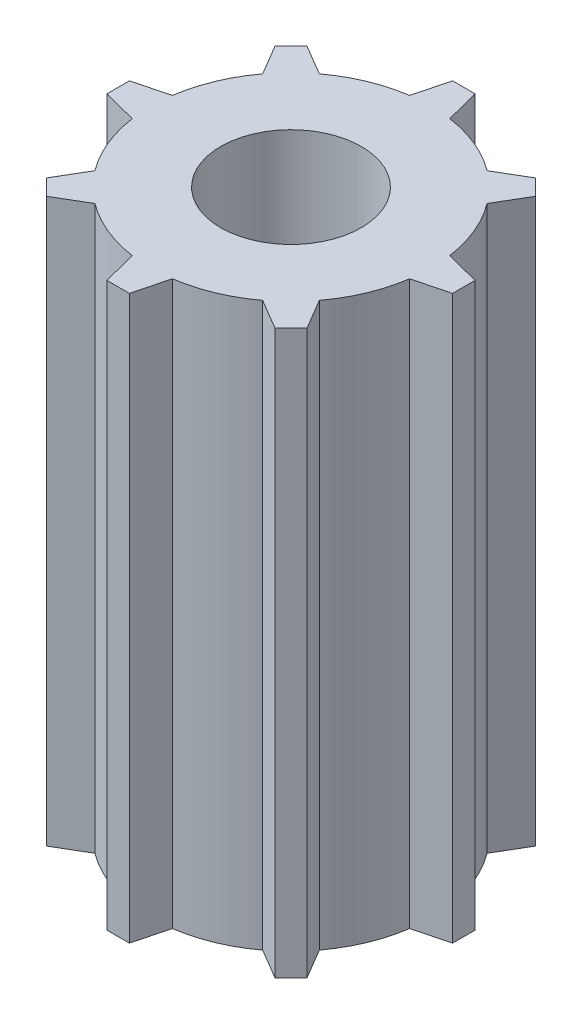
ISO-10303-21;
HEADER;
FILE_DESCRIPTION(('STEP AP214'),'2;1');
FILE_NAME('part.step','',(''),(''),'','','');
FILE_SCHEMA(('AUTOMOTIVE_DESIGN { 1 0 10303 214 1 1 1 1 }'));
ENDSEC;
DATA;
#1=APPLICATION_CONTEXT('core data for automotive mechanical design processes');
#2=APPLICATION_PROTOCOL_DEFINITION('international standard','automotive_design',2000,#1);
#3=PRODUCT_CONTEXT('',#1,'mechanical');
#4=PRODUCT('Part','Part','',(#3));
#5=PRODUCT_RELATED_PRODUCT_CATEGORY('part','',(#4));
#6=PRODUCT_DEFINITION_FORMATION('','',#4);
#7=PRODUCT_DEFINITION_CONTEXT('part definition',#1,'design');
#8=PRODUCT_DEFINITION('design','',#6,#7);
#9=PRODUCT_DEFINITION_SHAPE('','',#8);
#10=(LENGTH_UNIT() NAMED_UNIT(*) SI_UNIT(.MILLI.,.METRE.));
#11=(NAMED_UNIT(*) PLANE_ANGLE_UNIT() SI_UNIT($,.RADIAN.));
#12=(NAMED_UNIT(*) SI_UNIT($,.STERADIAN.) SOLID_ANGLE_UNIT());
#13=UNCERTAINTY_MEASURE_WITH_UNIT(LENGTH_MEASURE(1.E-05),#10,'distance_accuracy_value','');
#14=(GEOMETRIC_REPRESENTATION_CONTEXT(3) GLOBAL_UNCERTAINTY_ASSIGNED_CONTEXT((#13)) GLOBAL_UNIT_ASSIGNED_CONTEXT((#10,
#11,#12)) REPRESENTATION_CONTEXT('',''));
#15=CARTESIAN_POINT('',(0.,0.,0.));
#16=DIRECTION('',(0.,0.,1.));
#17=DIRECTION('',(1.,0.,0.));
#18=AXIS2_PLACEMENT_3D('',#15,#16,#17);
#19=CARTESIAN_POINT('',(-0.508000000001004,25.4,-7.80020665490494));
#20=DIRECTION('',(0.,0.,1.));
#21=DIRECTION('',(1.,0.,0.));
#22=AXIS2_PLACEMENT_3D('',#19,#20,#21);
#23=PLANE('',#22);
#24=DIRECTION('',(-1.,0.,0.));
#25=VECTOR('',#24,1.);
#26=CARTESIAN_POINT('',(-0.508000000001004,0.,-7.80020665490494));
#27=LINE('',#26,#25);
#28=CARTESIAN_POINT('',(0.507999999998996,0.,-7.80020665490494));
#29=VERTEX_POINT('',#28);
#30=CARTESIAN_POINT('',(-0.508000000001004,0.,-7.80020665490494));
#31=VERTEX_POINT('',#30);
#32=EDGE_CURVE('E280',#29,#31,#27,.T.);
#33=ORIENTED_EDGE('',*,*,#32,.T.);
#34=DIRECTION('',(0.,-1.,0.));
#35=VECTOR('',#34,1.);
#36=CARTESIAN_POINT('',(-0.508000000001004,25.4,-7.80020665490494));
#37=LINE('',#36,#35);
#38=CARTESIAN_POINT('',(-0.508000000001004,25.4,-7.80020665490494));
#39=VERTEX_POINT('',#38);
#40=EDGE_CURVE('E11',#39,#31,#37,.T.);
#41=ORIENTED_EDGE('',*,*,#40,.F.);
#42=DIRECTION('',(-1.,0.,0.));
#43=VECTOR('',#42,1.);
#44=CARTESIAN_POINT('',(-0.508000000001004,25.4,-7.80020665490494));
#45=LINE('',#44,#43);
#46=CARTESIAN_POINT('',(0.507999999998996,25.4,-7.80020665490494));
#47=VERTEX_POINT('',#46);
#48=EDGE_CURVE('E342',#47,#39,#45,.T.);
#49=ORIENTED_EDGE('',*,*,#48,.F.);
#50=DIRECTION('',(0.,-1.,0.));
#51=VECTOR('',#50,1.);
#52=CARTESIAN_POINT('',(0.507999999998996,25.4,-7.80020665490494));
#53=LINE('',#52,#51);
#54=EDGE_CURVE('E276',#47,#29,#53,.T.);
#55=ORIENTED_EDGE('',*,*,#54,.T.);
#56=EDGE_LOOP('',(#33,#41,#49,#55));
#57=FACE_BOUND('',#56,.T.);
#58=ADVANCED_FACE('F39',(#57),#23,.F.);
#59=CARTESIAN_POINT('',(-0.905835841654313,25.4,-6.25939506565726));
#60=DIRECTION('',(0.968245836551855,0.,0.249999999999998));
#61=DIRECTION('',(0.249999999999998,0.,-0.968245836551855));
#62=AXIS2_PLACEMENT_3D('',#59,#60,#61);
#63=PLANE('',#62);
#64=DIRECTION('',(-0.249999999999998,0.,0.968245836551855));
#65=VECTOR('',#64,1.);
#66=CARTESIAN_POINT('',(-0.905835841654313,0.,-6.25939506565726));
#67=LINE('',#66,#65);
#68=CARTESIAN_POINT('',(-0.905835841654313,0.,-6.25939506565726));
#69=VERTEX_POINT('',#68);
#70=EDGE_CURVE('E283',#31,#69,#67,.T.);
#71=ORIENTED_EDGE('',*,*,#70,.T.);
#72=DIRECTION('',(0.,-1.,0.));
#73=VECTOR('',#72,1.);
#74=CARTESIAN_POINT('',(-0.905835841654313,25.4,-6.25939506565726));
#75=LINE('',#74,#73);
#76=CARTESIAN_POINT('',(-0.905835841654313,25.4,-6.25939506565726));
#77=VERTEX_POINT('',#76);
#78=EDGE_CURVE('E48',#77,#69,#75,.T.);
#79=ORIENTED_EDGE('',*,*,#78,.F.);
#80=DIRECTION('',(-0.249999999999998,0.,0.968245836551855));
#81=VECTOR('',#80,1.);
#82=CARTESIAN_POINT('',(-0.905835841654313,25.4,-6.25939506565726));
#83=LINE('',#82,#81);
#84=EDGE_CURVE('E171',#39,#77,#83,.T.);
#85=ORIENTED_EDGE('',*,*,#84,.F.);
#86=ORIENTED_EDGE('',*,*,#40,.T.);
#87=EDGE_LOOP('',(#71,#79,#85,#86));
#88=FACE_BOUND('',#87,.T.);
#89=ADVANCED_FACE('F522',(#88),#63,.F.);
#90=CARTESIAN_POINT('',(0.,25.4,0.));
#91=DIRECTION('',(0.,-1.,0.));
#92=DIRECTION('',(0.,0.,-1.));
#93=AXIS2_PLACEMENT_3D('',#90,#91,#92);
#94=CYLINDRICAL_SURFACE('',#93,6.3246);
#95=CARTESIAN_POINT('',(0.,0.,0.));
#96=DIRECTION('',(0.,1.,0.));
#97=DIRECTION('',(0.,0.,1.));
#98=AXIS2_PLACEMENT_3D('',#95,#96,#97);
#99=CIRCLE('',#98,6.3246);
#100=CARTESIAN_POINT('',(-3.78553803077796,0.,-5.06658336332619));
#101=VERTEX_POINT('',#100);
#102=EDGE_CURVE('E285',#69,#101,#99,.T.);
#103=ORIENTED_EDGE('',*,*,#102,.T.);
#104=DIRECTION('',(0.,-1.,0.));
#105=VECTOR('',#104,1.);
#106=CARTESIAN_POINT('',(-3.78553803077796,25.4,-5.06658336332619));
#107=LINE('',#106,#105);
#108=CARTESIAN_POINT('',(-3.78553803077796,25.4,-5.06658336332619));
#109=VERTEX_POINT('',#108);
#110=EDGE_CURVE('E421',#109,#101,#107,.T.);
#111=ORIENTED_EDGE('',*,*,#110,.F.);
#112=CARTESIAN_POINT('',(0.,25.4,0.));
#113=DIRECTION('',(0.,1.,0.));
#114=DIRECTION('',(0.,0.,1.));
#115=AXIS2_PLACEMENT_3D('',#112,#113,#114);
#116=CIRCLE('',#115,6.3246);
#117=EDGE_CURVE('E430',#77,#109,#116,.T.);
#118=ORIENTED_EDGE('',*,*,#117,.F.);
#119=ORIENTED_EDGE('',*,*,#78,.T.);
#120=EDGE_LOOP('',(#103,#111,#118,#119));
#121=FACE_BOUND('',#120,.T.);
#122=ADVANCED_FACE('F428',(#121),#94,.T.);
#123=CARTESIAN_POINT('',(-3.78553803077796,25.4,-5.06658336332619));
#124=DIRECTION('',(-0.50787650158482,0.,0.861429892178095));
#125=DIRECTION('',(0.861429892178095,0.,0.50787650158482));
#126=AXIS2_PLACEMENT_3D('',#123,#124,#125);
#127=PLANE('',#126);
#128=DIRECTION('',(-0.861429892178095,0.,-0.50787650158482));
#129=VECTOR('',#128,1.);
#130=CARTESIAN_POINT('',(-3.78553803077796,0.,-5.06658336332619));
#131=LINE('',#130,#129);
#132=CARTESIAN_POINT('',(-5.15636877549766,0.,-5.87478926518178));
#133=VERTEX_POINT('',#132);
#134=EDGE_CURVE('E287',#101,#133,#131,.T.);
#135=ORIENTED_EDGE('',*,*,#134,.T.);
#136=DIRECTION('',(0.,-1.,0.));
#137=VECTOR('',#136,1.);
#138=CARTESIAN_POINT('',(-5.15636877549766,25.4,-5.87478926518178));
#139=LINE('',#138,#137);
#140=CARTESIAN_POINT('',(-5.15636877549766,25.4,-5.87478926518178));
#141=VERTEX_POINT('',#140);
#142=EDGE_CURVE('E418',#141,#133,#139,.T.);
#143=ORIENTED_EDGE('',*,*,#142,.F.);
#144=DIRECTION('',(-0.861429892178095,0.,-0.50787650158482));
#145=VECTOR('',#144,1.);
#146=CARTESIAN_POINT('',(-3.78553803077796,25.4,-5.06658336332619));
#147=LINE('',#146,#145);
#148=EDGE_CURVE('E448',#109,#141,#147,.T.);
#149=ORIENTED_EDGE('',*,*,#148,.F.);
#150=ORIENTED_EDGE('',*,*,#110,.T.);
#151=EDGE_LOOP('',(#135,#143,#149,#150));
#152=FACE_BOUND('',#151,.T.);
#153=ADVANCED_FACE('F439',(#152),#127,.F.);
#154=CARTESIAN_POINT('',(-5.8747892651832,25.4,-5.15636877549625));
#155=DIRECTION('',(0.707106781186548,0.,0.707106781186548));
#156=DIRECTION('',(0.707106781186548,0.,-0.707106781186548));
#157=AXIS2_PLACEMENT_3D('',#154,#155,#156);
#158=PLANE('',#157);
#159=DIRECTION('',(-0.707106781186548,0.,0.707106781186548));
#160=VECTOR('',#159,1.);
#161=CARTESIAN_POINT('',(-5.8747892651832,0.,-5.15636877549625));
#162=LINE('',#161,#160);
#163=CARTESIAN_POINT('',(-5.8747892651832,0.,-5.15636877549625));
#164=VERTEX_POINT('',#163);
#165=EDGE_CURVE('E289',#133,#164,#162,.T.);
#166=ORIENTED_EDGE('',*,*,#165,.T.);
#167=DIRECTION('',(0.,-1.,0.));
#168=VECTOR('',#167,1.);
#169=CARTESIAN_POINT('',(-5.8747892651832,25.4,-5.15636877549625));
#170=LINE('',#169,#168);
#171=CARTESIAN_POINT('',(-5.8747892651832,25.4,-5.15636877549625));
#172=VERTEX_POINT('',#171);
#173=EDGE_CURVE('E415',#172,#164,#170,.T.);
#174=ORIENTED_EDGE('',*,*,#173,.F.);
#175=DIRECTION('',(-0.707106781186548,0.,0.707106781186548));
#176=VECTOR('',#175,1.);
#177=CARTESIAN_POINT('',(-5.8747892651832,25.4,-5.15636877549625));
#178=LINE('',#177,#176);
#179=EDGE_CURVE('E445',#141,#172,#178,.T.);
#180=ORIENTED_EDGE('',*,*,#179,.F.);
#181=ORIENTED_EDGE('',*,*,#142,.T.);
#182=EDGE_LOOP('',(#166,#174,#180,#181));
#183=FACE_BOUND('',#182,.T.);
#184=ADVANCED_FACE('F443',(#183),#158,.F.);
#185=CARTESIAN_POINT('',(-5.06658336332745,25.4,-3.78553803077627));
#186=DIRECTION('',(0.861429892178093,0.,-0.507876501584822));
#187=DIRECTION('',(-0.507876501584823,0.,-0.861429892178094));
#188=AXIS2_PLACEMENT_3D('',#185,#186,#187);
#189=PLANE('',#188);
#190=DIRECTION('',(0.507876501584822,0.,0.861429892178094));
#191=VECTOR('',#190,1.);
#192=CARTESIAN_POINT('',(-5.06658336332745,0.,-3.78553803077627));
#193=LINE('',#192,#191);
#194=CARTESIAN_POINT('',(-5.06658336332745,0.,-3.78553803077627));
#195=VERTEX_POINT('',#194);
#196=EDGE_CURVE('E291',#164,#195,#193,.T.);
#197=ORIENTED_EDGE('',*,*,#196,.T.);
#198=DIRECTION('',(0.,-1.,0.));
#199=VECTOR('',#198,1.);
#200=CARTESIAN_POINT('',(-5.06658336332745,25.4,-3.78553803077627));
#201=LINE('',#200,#199);
#202=CARTESIAN_POINT('',(-5.06658336332745,25.4,-3.78553803077627));
#203=VERTEX_POINT('',#202);
#204=EDGE_CURVE('E412',#203,#195,#201,.T.);
#205=ORIENTED_EDGE('',*,*,#204,.F.);
#206=DIRECTION('',(0.507876501584822,0.,0.861429892178094));
#207=VECTOR('',#206,1.);
#208=CARTESIAN_POINT('',(-5.06658336332745,25.4,-3.78553803077627));
#209=LINE('',#208,#207);
#210=EDGE_CURVE('E447',#172,#203,#209,.T.);
#211=ORIENTED_EDGE('',*,*,#210,.F.);
#212=ORIENTED_EDGE('',*,*,#173,.T.);
#213=EDGE_LOOP('',(#197,#205,#211,#212));
#214=FACE_BOUND('',#213,.T.);
#215=ADVANCED_FACE('F535',(#214),#189,.F.);
#216=CARTESIAN_POINT('',(0.,25.4,0.));
#217=DIRECTION('',(0.,-1.,0.));
#218=DIRECTION('',(0.,0.,-1.));
#219=AXIS2_PLACEMENT_3D('',#216,#217,#218);
#220=CYLINDRICAL_SURFACE('',#219,6.3246);
#221=CARTESIAN_POINT('',(0.,0.,0.));
#222=DIRECTION('',(0.,1.,0.));
#223=DIRECTION('',(0.,0.,1.));
#224=AXIS2_PLACEMENT_3D('',#221,#222,#223);
#225=CIRCLE('',#224,6.3246);
#226=CARTESIAN_POINT('',(-6.25939506565756,0.,-0.905835841652237));
#227=VERTEX_POINT('',#226);
#228=EDGE_CURVE('E293',#195,#227,#225,.T.);
#229=ORIENTED_EDGE('',*,*,#228,.T.);
#230=DIRECTION('',(0.,-1.,0.));
#231=VECTOR('',#230,1.);
#232=CARTESIAN_POINT('',(-6.25939506565756,25.4,-0.905835841652237));
#233=LINE('',#232,#231);
#234=CARTESIAN_POINT('',(-6.25939506565756,25.4,-0.905835841652237));
#235=VERTEX_POINT('',#234);
#236=EDGE_CURVE('E409',#235,#227,#233,.T.);
#237=ORIENTED_EDGE('',*,*,#236,.F.);
#238=CARTESIAN_POINT('',(0.,25.4,0.));
#239=DIRECTION('',(0.,1.,0.));
#240=DIRECTION('',(0.,0.,1.));
#241=AXIS2_PLACEMENT_3D('',#238,#239,#240);
#242=CIRCLE('',#241,6.3246);
#243=EDGE_CURVE('E450',#203,#235,#242,.T.);
#244=ORIENTED_EDGE('',*,*,#243,.F.);
#245=ORIENTED_EDGE('',*,*,#204,.T.);
#246=EDGE_LOOP('',(#229,#237,#244,#245));
#247=FACE_BOUND('',#246,.T.);
#248=ADVANCED_FACE('F538',(#247),#220,.T.);
#249=CARTESIAN_POINT('',(-6.25939506565756,25.4,-0.905835841652234));
#250=DIRECTION('',(0.250000000000001,0.,0.968245836551854));
#251=DIRECTION('',(0.968245836551854,0.,-0.250000000000001));
#252=AXIS2_PLACEMENT_3D('',#249,#250,#251);
#253=PLANE('',#252);
#254=DIRECTION('',(-0.968245836551854,0.,0.250000000000001));
#255=VECTOR('',#254,1.);
#256=CARTESIAN_POINT('',(-6.25939506565756,0.,-0.905835841652234));
#257=LINE('',#256,#255);
#258=CARTESIAN_POINT('',(-7.80020665490494,0.,-0.507999999998998));
#259=VERTEX_POINT('',#258);
#260=EDGE_CURVE('E295',#227,#259,#257,.T.);
#261=ORIENTED_EDGE('',*,*,#260,.T.);
#262=DIRECTION('',(0.,-1.,0.));
#263=VECTOR('',#262,1.);
#264=CARTESIAN_POINT('',(-7.80020665490494,25.4,-0.507999999998998));
#265=LINE('',#264,#263);
#266=CARTESIAN_POINT('',(-7.80020665490494,25.4,-0.507999999998998));
#267=VERTEX_POINT('',#266);
#268=EDGE_CURVE('E406',#267,#259,#265,.T.);
#269=ORIENTED_EDGE('',*,*,#268,.F.);
#270=DIRECTION('',(-0.968245836551854,0.,0.250000000000001));
#271=VECTOR('',#270,1.);
#272=CARTESIAN_POINT('',(-6.25939506565756,25.4,-0.905835841652234));
#273=LINE('',#272,#271);
#274=EDGE_CURVE('E456',#235,#267,#273,.T.);
#275=ORIENTED_EDGE('',*,*,#274,.F.);
#276=ORIENTED_EDGE('',*,*,#236,.T.);
#277=EDGE_LOOP('',(#261,#269,#275,#276));
#278=FACE_BOUND('',#277,.T.);
#279=ADVANCED_FACE('F542',(#278),#253,.F.);
#280=CARTESIAN_POINT('',(-7.80020665490494,25.4,0.508000000001002));
#281=DIRECTION('',(1.,0.,0.));
#282=DIRECTION('',(0.,0.,-1.));
#283=AXIS2_PLACEMENT_3D('',#280,#281,#282);
#284=PLANE('',#283);
#285=DIRECTION('',(0.,0.,1.));
#286=VECTOR('',#285,1.);
#287=CARTESIAN_POINT('',(-7.80020665490494,0.,0.508000000001002));
#288=LINE('',#287,#286);
#289=CARTESIAN_POINT('',(-7.80020665490494,0.,0.508000000001002));
#290=VERTEX_POINT('',#289);
#291=EDGE_CURVE('E297',#259,#290,#288,.T.);
#292=ORIENTED_EDGE('',*,*,#291,.T.);
#293=DIRECTION('',(0.,-1.,0.));
#294=VECTOR('',#293,1.);
#295=CARTESIAN_POINT('',(-7.80020665490494,25.4,0.508000000001002));
#296=LINE('',#295,#294);
#297=CARTESIAN_POINT('',(-7.80020665490494,25.4,0.508000000001002));
#298=VERTEX_POINT('',#297);
#299=EDGE_CURVE('E403',#298,#290,#296,.T.);
#300=ORIENTED_EDGE('',*,*,#299,.F.);
#301=DIRECTION('',(0.,0.,1.));
#302=VECTOR('',#301,1.);
#303=CARTESIAN_POINT('',(-7.80020665490494,25.4,0.508000000001002));
#304=LINE('',#303,#302);
#305=EDGE_CURVE('E458',#267,#298,#304,.T.);
#306=ORIENTED_EDGE('',*,*,#305,.F.);
#307=ORIENTED_EDGE('',*,*,#268,.T.);
#308=EDGE_LOOP('',(#292,#300,#306,#307));
#309=FACE_BOUND('',#308,.T.);
#310=ADVANCED_FACE('F546',(#309),#284,.F.);
#311=CARTESIAN_POINT('',(-6.25939506565726,25.4,0.90583584165431));
#312=DIRECTION('',(0.249999999999998,0.,-0.968245836551855));
#313=DIRECTION('',(-0.968245836551855,0.,-0.249999999999998));
#314=AXIS2_PLACEMENT_3D('',#311,#312,#313);
#315=PLANE('',#314);
#316=DIRECTION('',(0.968245836551855,0.,0.249999999999998));
#317=VECTOR('',#316,1.);
#318=CARTESIAN_POINT('',(-6.25939506565726,0.,0.90583584165431));
#319=LINE('',#318,#317);
#320=CARTESIAN_POINT('',(-6.25939506565726,0.,0.90583584165431));
#321=VERTEX_POINT('',#320);
#322=EDGE_CURVE('E299',#290,#321,#319,.T.);
#323=ORIENTED_EDGE('',*,*,#322,.T.);
#324=DIRECTION('',(0.,-1.,0.));
#325=VECTOR('',#324,1.);
#326=CARTESIAN_POINT('',(-6.25939506565726,25.4,0.90583584165431));
#327=LINE('',#326,#325);
#328=CARTESIAN_POINT('',(-6.25939506565726,25.4,0.90583584165431));
#329=VERTEX_POINT('',#328);
#330=EDGE_CURVE('E400',#329,#321,#327,.T.);
#331=ORIENTED_EDGE('',*,*,#330,.F.);
#332=DIRECTION('',(0.968245836551855,0.,0.249999999999998));
#333=VECTOR('',#332,1.);
#334=CARTESIAN_POINT('',(-6.25939506565726,25.4,0.90583584165431));
#335=LINE('',#334,#333);
#336=EDGE_CURVE('E460',#298,#329,#335,.T.);
#337=ORIENTED_EDGE('',*,*,#336,.F.);
#338=ORIENTED_EDGE('',*,*,#299,.T.);
#339=EDGE_LOOP('',(#323,#331,#337,#338));
#340=FACE_BOUND('',#339,.T.);
#341=ADVANCED_FACE('F550',(#340),#315,.F.);
#342=CARTESIAN_POINT('',(0.,25.4,0.));
#343=DIRECTION('',(0.,-1.,0.));
#344=DIRECTION('',(0.,0.,-1.));
#345=AXIS2_PLACEMENT_3D('',#342,#343,#344);
#346=CYLINDRICAL_SURFACE('',#345,6.3246);
#347=CARTESIAN_POINT('',(0.,0.,0.));
#348=DIRECTION('',(0.,1.,0.));
#349=DIRECTION('',(0.,0.,1.));
#350=AXIS2_PLACEMENT_3D('',#347,#348,#349);
#351=CIRCLE('',#350,6.3246);
#352=CARTESIAN_POINT('',(-5.06658336332619,0.,3.78553803077795));
#353=VERTEX_POINT('',#352);
#354=EDGE_CURVE('E301',#321,#353,#351,.T.);
#355=ORIENTED_EDGE('',*,*,#354,.T.);
#356=DIRECTION('',(0.,-1.,0.));
#357=VECTOR('',#356,1.);
#358=CARTESIAN_POINT('',(-5.06658336332619,25.4,3.78553803077795));
#359=LINE('',#358,#357);
#360=CARTESIAN_POINT('',(-5.06658336332619,25.4,3.78553803077795));
#361=VERTEX_POINT('',#360);
#362=EDGE_CURVE('E397',#361,#353,#359,.T.);
#363=ORIENTED_EDGE('',*,*,#362,.F.);
#364=CARTESIAN_POINT('',(0.,25.4,0.));
#365=DIRECTION('',(0.,1.,0.));
#366=DIRECTION('',(0.,0.,1.));
#367=AXIS2_PLACEMENT_3D('',#364,#365,#366);
#368=CIRCLE('',#367,6.3246);
#369=EDGE_CURVE('E462',#329,#361,#368,.T.);
#370=ORIENTED_EDGE('',*,*,#369,.F.);
#371=ORIENTED_EDGE('',*,*,#330,.T.);
#372=EDGE_LOOP('',(#355,#363,#370,#371));
#373=FACE_BOUND('',#372,.T.);
#374=ADVANCED_FACE('F554',(#373),#346,.T.);
#375=CARTESIAN_POINT('',(-5.06658336332619,25.4,3.78553803077795));
#376=DIRECTION('',(0.861429892178095,0.,0.50787650158482));
#377=DIRECTION('',(0.50787650158482,0.,-0.861429892178095));
#378=AXIS2_PLACEMENT_3D('',#375,#376,#377);
#379=PLANE('',#378);
#380=DIRECTION('',(-0.50787650158482,0.,0.861429892178095));
#381=VECTOR('',#380,1.);
#382=CARTESIAN_POINT('',(-5.06658336332619,0.,3.78553803077795));
#383=LINE('',#382,#381);
#384=CARTESIAN_POINT('',(-5.87478926518178,0.,5.15636877549766));
#385=VERTEX_POINT('',#384);
#386=EDGE_CURVE('E303',#353,#385,#383,.T.);
#387=ORIENTED_EDGE('',*,*,#386,.T.);
#388=DIRECTION('',(0.,-1.,0.));
#389=VECTOR('',#388,1.);
#390=CARTESIAN_POINT('',(-5.87478926518178,25.4,5.15636877549766));
#391=LINE('',#390,#389);
#392=CARTESIAN_POINT('',(-5.87478926518178,25.4,5.15636877549766));
#393=VERTEX_POINT('',#392);
#394=EDGE_CURVE('E394',#393,#385,#391,.T.);
#395=ORIENTED_EDGE('',*,*,#394,.F.);
#396=DIRECTION('',(-0.50787650158482,0.,0.861429892178095));
#397=VECTOR('',#396,1.);
#398=CARTESIAN_POINT('',(-5.06658336332619,25.4,3.78553803077795));
#399=LINE('',#398,#397);
#400=EDGE_CURVE('E464',#361,#393,#399,.T.);
#401=ORIENTED_EDGE('',*,*,#400,.F.);
#402=ORIENTED_EDGE('',*,*,#362,.T.);
#403=EDGE_LOOP('',(#387,#395,#401,#402));
#404=FACE_BOUND('',#403,.T.);
#405=ADVANCED_FACE('F558',(#404),#379,.F.);
#406=CARTESIAN_POINT('',(-5.15636877549624,25.4,5.87478926518319));
#407=DIRECTION('',(0.707106781186548,0.,-0.707106781186548));
#408=DIRECTION('',(-0.707106781186548,0.,-0.707106781186548));
#409=AXIS2_PLACEMENT_3D('',#406,#407,#408);
#410=PLANE('',#409);
#411=DIRECTION('',(0.707106781186548,0.,0.707106781186548));
#412=VECTOR('',#411,1.);
#413=CARTESIAN_POINT('',(-5.15636877549624,0.,5.87478926518319));
#414=LINE('',#413,#412);
#415=CARTESIAN_POINT('',(-5.15636877549624,0.,5.87478926518319));
#416=VERTEX_POINT('',#415);
#417=EDGE_CURVE('E305',#385,#416,#414,.T.);
#418=ORIENTED_EDGE('',*,*,#417,.T.);
#419=DIRECTION('',(0.,-1.,0.));
#420=VECTOR('',#419,1.);
#421=CARTESIAN_POINT('',(-5.15636877549624,25.4,5.87478926518319));
#422=LINE('',#421,#420);
#423=CARTESIAN_POINT('',(-5.15636877549624,25.4,5.87478926518319));
#424=VERTEX_POINT('',#423);
#425=EDGE_CURVE('E391',#424,#416,#422,.T.);
#426=ORIENTED_EDGE('',*,*,#425,.F.);
#427=DIRECTION('',(0.707106781186548,0.,0.707106781186548));
#428=VECTOR('',#427,1.);
#429=CARTESIAN_POINT('',(-5.15636877549624,25.4,5.87478926518319));
#430=LINE('',#429,#428);
#431=EDGE_CURVE('E466',#393,#424,#430,.T.);
#432=ORIENTED_EDGE('',*,*,#431,.F.);
#433=ORIENTED_EDGE('',*,*,#394,.T.);
#434=EDGE_LOOP('',(#418,#426,#432,#433));
#435=FACE_BOUND('',#434,.T.);
#436=ADVANCED_FACE('F562',(#435),#410,.F.);
#437=CARTESIAN_POINT('',(-3.78553803077627,25.4,5.06658336332745));
#438=DIRECTION('',(-0.507876501584822,0.,-0.861429892178094));
#439=DIRECTION('',(-0.861429892178094,0.,0.507876501584822));
#440=AXIS2_PLACEMENT_3D('',#437,#438,#439);
#441=PLANE('',#440);
#442=DIRECTION('',(0.861429892178094,0.,-0.507876501584822));
#443=VECTOR('',#442,1.);
#444=CARTESIAN_POINT('',(-3.78553803077627,0.,5.06658336332745));
#445=LINE('',#444,#443);
#446=CARTESIAN_POINT('',(-3.78553803077627,0.,5.06658336332745));
#447=VERTEX_POINT('',#446);
#448=EDGE_CURVE('E307',#416,#447,#445,.T.);
#449=ORIENTED_EDGE('',*,*,#448,.T.);
#450=DIRECTION('',(0.,-1.,0.));
#451=VECTOR('',#450,1.);
#452=CARTESIAN_POINT('',(-3.78553803077627,25.4,5.06658336332745));
#453=LINE('',#452,#451);
#454=CARTESIAN_POINT('',(-3.78553803077627,25.4,5.06658336332745));
#455=VERTEX_POINT('',#454);
#456=EDGE_CURVE('E388',#455,#447,#453,.T.);
#457=ORIENTED_EDGE('',*,*,#456,.F.);
#458=DIRECTION('',(0.861429892178094,0.,-0.507876501584822));
#459=VECTOR('',#458,1.);
#460=CARTESIAN_POINT('',(-3.78553803077627,25.4,5.06658336332745));
#461=LINE('',#460,#459);
#462=EDGE_CURVE('E468',#424,#455,#461,.T.);
#463=ORIENTED_EDGE('',*,*,#462,.F.);
#464=ORIENTED_EDGE('',*,*,#425,.T.);
#465=EDGE_LOOP('',(#449,#457,#463,#464));
#466=FACE_BOUND('',#465,.T.);
#467=ADVANCED_FACE('F566',(#466),#441,.F.);
#468=CARTESIAN_POINT('',(0.,25.4,0.));
#469=DIRECTION('',(0.,-1.,0.));
#470=DIRECTION('',(0.,0.,-1.));
#471=AXIS2_PLACEMENT_3D('',#468,#469,#470);
#472=CYLINDRICAL_SURFACE('',#471,6.32459999999999);
#473=CARTESIAN_POINT('',(0.,0.,0.));
#474=DIRECTION('',(0.,1.,0.));
#475=DIRECTION('',(0.,0.,1.));
#476=AXIS2_PLACEMENT_3D('',#473,#474,#475);
#477=CIRCLE('',#476,6.32459999999999);
#478=CARTESIAN_POINT('',(-0.905835841652232,0.,6.25939506565755));
#479=VERTEX_POINT('',#478);
#480=EDGE_CURVE('E309',#447,#479,#477,.T.);
#481=ORIENTED_EDGE('',*,*,#480,.T.);
#482=DIRECTION('',(0.,-1.,0.));
#483=VECTOR('',#482,1.);
#484=CARTESIAN_POINT('',(-0.905835841652232,25.4,6.25939506565755));
#485=LINE('',#484,#483);
#486=CARTESIAN_POINT('',(-0.905835841652232,25.4,6.25939506565755));
#487=VERTEX_POINT('',#486);
#488=EDGE_CURVE('E385',#487,#479,#485,.T.);
#489=ORIENTED_EDGE('',*,*,#488,.F.);
#490=CARTESIAN_POINT('',(0.,25.4,0.));
#491=DIRECTION('',(0.,1.,0.));
#492=DIRECTION('',(0.,0.,1.));
#493=AXIS2_PLACEMENT_3D('',#490,#491,#492);
#494=CIRCLE('',#493,6.32459999999999);
#495=EDGE_CURVE('E470',#455,#487,#494,.T.);
#496=ORIENTED_EDGE('',*,*,#495,.F.);
#497=ORIENTED_EDGE('',*,*,#456,.T.);
#498=EDGE_LOOP('',(#481,#489,#496,#497));
#499=FACE_BOUND('',#498,.T.);
#500=ADVANCED_FACE('F570',(#499),#472,.T.);
#501=CARTESIAN_POINT('',(-0.905835841652232,25.4,6.25939506565755));
#502=DIRECTION('',(0.968245836551854,0.,-0.250000000000001));
#503=DIRECTION('',(-0.250000000000001,0.,-0.968245836551854));
#504=AXIS2_PLACEMENT_3D('',#501,#502,#503);
#505=PLANE('',#504);
#506=DIRECTION('',(0.250000000000001,0.,0.968245836551854));
#507=VECTOR('',#506,1.);
#508=CARTESIAN_POINT('',(-0.905835841652232,0.,6.25939506565755));
#509=LINE('',#508,#507);
#510=CARTESIAN_POINT('',(-0.507999999998996,0.,7.80020665490494));
#511=VERTEX_POINT('',#510);
#512=EDGE_CURVE('E311',#479,#511,#509,.T.);
#513=ORIENTED_EDGE('',*,*,#512,.T.);
#514=DIRECTION('',(0.,-1.,0.));
#515=VECTOR('',#514,1.);
#516=CARTESIAN_POINT('',(-0.507999999998996,25.4,7.80020665490494));
#517=LINE('',#516,#515);
#518=CARTESIAN_POINT('',(-0.507999999998996,25.4,7.80020665490494));
#519=VERTEX_POINT('',#518);
#520=EDGE_CURVE('E382',#519,#511,#517,.T.);
#521=ORIENTED_EDGE('',*,*,#520,.F.);
#522=DIRECTION('',(0.250000000000001,0.,0.968245836551854));
#523=VECTOR('',#522,1.);
#524=CARTESIAN_POINT('',(-0.905835841652232,25.4,6.25939506565755));
#525=LINE('',#524,#523);
#526=EDGE_CURVE('E472',#487,#519,#525,.T.);
#527=ORIENTED_EDGE('',*,*,#526,.F.);
#528=ORIENTED_EDGE('',*,*,#488,.T.);
#529=EDGE_LOOP('',(#513,#521,#527,#528));
#530=FACE_BOUND('',#529,.T.);
#531=ADVANCED_FACE('F574',(#530),#505,.F.);
#532=CARTESIAN_POINT('',(0.508000000001004,25.4,7.80020665490494));
#533=DIRECTION('',(0.,0.,-1.));
#534=DIRECTION('',(-1.,0.,0.));
#535=AXIS2_PLACEMENT_3D('',#532,#533,#534);
#536=PLANE('',#535);
#537=DIRECTION('',(1.,0.,0.));
#538=VECTOR('',#537,1.);
#539=CARTESIAN_POINT('',(0.508000000001004,0.,7.80020665490494));
#540=LINE('',#539,#538);
#541=CARTESIAN_POINT('',(0.508000000001004,0.,7.80020665490494));
#542=VERTEX_POINT('',#541);
#543=EDGE_CURVE('E313',#511,#542,#540,.T.);
#544=ORIENTED_EDGE('',*,*,#543,.T.);
#545=DIRECTION('',(0.,-1.,0.));
#546=VECTOR('',#545,1.);
#547=CARTESIAN_POINT('',(0.508000000001004,25.4,7.80020665490494));
#548=LINE('',#547,#546);
#549=CARTESIAN_POINT('',(0.508000000001004,25.4,7.80020665490494));
#550=VERTEX_POINT('',#549);
#551=EDGE_CURVE('E379',#550,#542,#548,.T.);
#552=ORIENTED_EDGE('',*,*,#551,.F.);
#553=DIRECTION('',(1.,0.,0.));
#554=VECTOR('',#553,1.);
#555=CARTESIAN_POINT('',(0.508000000001004,25.4,7.80020665490494));
#556=LINE('',#555,#554);
#557=EDGE_CURVE('E474',#519,#550,#556,.T.);
#558=ORIENTED_EDGE('',*,*,#557,.F.);
#559=ORIENTED_EDGE('',*,*,#520,.T.);
#560=EDGE_LOOP('',(#544,#552,#558,#559));
#561=FACE_BOUND('',#560,.T.);
#562=ADVANCED_FACE('F578',(#561),#536,.F.);
#563=CARTESIAN_POINT('',(0.905835841654312,25.4,6.25939506565725));
#564=DIRECTION('',(-0.968245836551855,0.,-0.249999999999998));
#565=DIRECTION('',(-0.249999999999998,0.,0.968245836551855));
#566=AXIS2_PLACEMENT_3D('',#563,#564,#565);
#567=PLANE('',#566);
#568=DIRECTION('',(0.249999999999998,0.,-0.968245836551855));
#569=VECTOR('',#568,1.);
#570=CARTESIAN_POINT('',(0.905835841654312,0.,6.25939506565725));
#571=LINE('',#570,#569);
#572=CARTESIAN_POINT('',(0.905835841654312,0.,6.25939506565725));
#573=VERTEX_POINT('',#572);
#574=EDGE_CURVE('E315',#542,#573,#571,.T.);
#575=ORIENTED_EDGE('',*,*,#574,.T.);
#576=DIRECTION('',(0.,-1.,0.));
#577=VECTOR('',#576,1.);
#578=CARTESIAN_POINT('',(0.905835841654312,25.4,6.25939506565725));
#579=LINE('',#578,#577);
#580=CARTESIAN_POINT('',(0.905835841654312,25.4,6.25939506565725));
#581=VERTEX_POINT('',#580);
#582=EDGE_CURVE('E376',#581,#573,#579,.T.);
#583=ORIENTED_EDGE('',*,*,#582,.F.);
#584=DIRECTION('',(0.249999999999998,0.,-0.968245836551855));
#585=VECTOR('',#584,1.);
#586=CARTESIAN_POINT('',(0.905835841654312,25.4,6.25939506565725));
#587=LINE('',#586,#585);
#588=EDGE_CURVE('E476',#550,#581,#587,.T.);
#589=ORIENTED_EDGE('',*,*,#588,.F.);
#590=ORIENTED_EDGE('',*,*,#551,.T.);
#591=EDGE_LOOP('',(#575,#583,#589,#590));
#592=FACE_BOUND('',#591,.T.);
#593=ADVANCED_FACE('F582',(#592),#567,.F.);
#594=CARTESIAN_POINT('',(0.,25.4,0.));
#595=DIRECTION('',(0.,-1.,0.));
#596=DIRECTION('',(0.,0.,-1.));
#597=AXIS2_PLACEMENT_3D('',#594,#595,#596);
#598=CYLINDRICAL_SURFACE('',#597,6.32459999999999);
#599=CARTESIAN_POINT('',(0.,0.,0.));
#600=DIRECTION('',(0.,1.,0.));
#601=DIRECTION('',(0.,0.,1.));
#602=AXIS2_PLACEMENT_3D('',#599,#600,#601);
#603=CIRCLE('',#602,6.32459999999999);
#604=CARTESIAN_POINT('',(3.78553803077795,0.,5.06658336332618));
#605=VERTEX_POINT('',#604);
#606=EDGE_CURVE('E317',#573,#605,#603,.T.);
#607=ORIENTED_EDGE('',*,*,#606,.T.);
#608=DIRECTION('',(0.,-1.,0.));
#609=VECTOR('',#608,1.);
#610=CARTESIAN_POINT('',(3.78553803077795,25.4,5.06658336332618));
#611=LINE('',#610,#609);
#612=CARTESIAN_POINT('',(3.78553803077795,25.4,5.06658336332618));
#613=VERTEX_POINT('',#612);
#614=EDGE_CURVE('E373',#613,#605,#611,.T.);
#615=ORIENTED_EDGE('',*,*,#614,.F.);
#616=CARTESIAN_POINT('',(0.,25.4,0.));
#617=DIRECTION('',(0.,1.,0.));
#618=DIRECTION('',(0.,0.,1.));
#619=AXIS2_PLACEMENT_3D('',#616,#617,#618);
#620=CIRCLE('',#619,6.32459999999999);
#621=EDGE_CURVE('E478',#581,#613,#620,.T.);
#622=ORIENTED_EDGE('',*,*,#621,.F.);
#623=ORIENTED_EDGE('',*,*,#582,.T.);
#624=EDGE_LOOP('',(#607,#615,#622,#623));
#625=FACE_BOUND('',#624,.T.);
#626=ADVANCED_FACE('F586',(#625),#598,.T.);
#627=CARTESIAN_POINT('',(3.78553803077796,25.4,5.06658336332619));
#628=DIRECTION('',(0.50787650158482,0.,-0.861429892178095));
#629=DIRECTION('',(-0.861429892178095,0.,-0.50787650158482));
#630=AXIS2_PLACEMENT_3D('',#627,#628,#629);
#631=PLANE('',#630);
#632=DIRECTION('',(0.861429892178095,0.,0.50787650158482));
#633=VECTOR('',#632,1.);
#634=CARTESIAN_POINT('',(3.78553803077796,0.,5.06658336332619));
#635=LINE('',#634,#633);
#636=CARTESIAN_POINT('',(5.15636877549766,0.,5.87478926518177));
#637=VERTEX_POINT('',#636);
#638=EDGE_CURVE('E319',#605,#637,#635,.T.);
#639=ORIENTED_EDGE('',*,*,#638,.T.);
#640=DIRECTION('',(0.,-1.,0.));
#641=VECTOR('',#640,1.);
#642=CARTESIAN_POINT('',(5.15636877549766,25.4,5.87478926518177));
#643=LINE('',#642,#641);
#644=CARTESIAN_POINT('',(5.15636877549766,25.4,5.87478926518177));
#645=VERTEX_POINT('',#644);
#646=EDGE_CURVE('E370',#645,#637,#643,.T.);
#647=ORIENTED_EDGE('',*,*,#646,.F.);
#648=DIRECTION('',(0.861429892178095,0.,0.50787650158482));
#649=VECTOR('',#648,1.);
#650=CARTESIAN_POINT('',(3.78553803077796,25.4,5.06658336332619));
#651=LINE('',#650,#649);
#652=EDGE_CURVE('E480',#613,#645,#651,.T.);
#653=ORIENTED_EDGE('',*,*,#652,.F.);
#654=ORIENTED_EDGE('',*,*,#614,.T.);
#655=EDGE_LOOP('',(#639,#647,#653,#654));
#656=FACE_BOUND('',#655,.T.);
#657=ADVANCED_FACE('F590',(#656),#631,.F.);
#658=CARTESIAN_POINT('',(5.87478926518319,25.4,5.15636877549624));
#659=DIRECTION('',(-0.707106781186548,0.,-0.707106781186548));
#660=DIRECTION('',(-0.707106781186548,0.,0.707106781186548));
#661=AXIS2_PLACEMENT_3D('',#658,#659,#660);
#662=PLANE('',#661);
#663=DIRECTION('',(0.707106781186548,0.,-0.707106781186548));
#664=VECTOR('',#663,1.);
#665=CARTESIAN_POINT('',(5.87478926518319,0.,5.15636877549624));
#666=LINE('',#665,#664);
#667=CARTESIAN_POINT('',(5.87478926518319,0.,5.15636877549624));
#668=VERTEX_POINT('',#667);
#669=EDGE_CURVE('E321',#637,#668,#666,.T.);
#670=ORIENTED_EDGE('',*,*,#669,.T.);
#671=DIRECTION('',(0.,-1.,0.));
#672=VECTOR('',#671,1.);
#673=CARTESIAN_POINT('',(5.87478926518319,25.4,5.15636877549624));
#674=LINE('',#673,#672);
#675=CARTESIAN_POINT('',(5.87478926518319,25.4,5.15636877549624));
#676=VERTEX_POINT('',#675);
#677=EDGE_CURVE('E367',#676,#668,#674,.T.);
#678=ORIENTED_EDGE('',*,*,#677,.F.);
#679=DIRECTION('',(0.707106781186548,0.,-0.707106781186548));
#680=VECTOR('',#679,1.);
#681=CARTESIAN_POINT('',(5.87478926518319,25.4,5.15636877549624));
#682=LINE('',#681,#680);
#683=EDGE_CURVE('E482',#645,#676,#682,.T.);
#684=ORIENTED_EDGE('',*,*,#683,.F.);
#685=ORIENTED_EDGE('',*,*,#646,.T.);
#686=EDGE_LOOP('',(#670,#678,#684,#685));
#687=FACE_BOUND('',#686,.T.);
#688=ADVANCED_FACE('F594',(#687),#662,.F.);
#689=CARTESIAN_POINT('',(5.06658336332745,25.4,3.78553803077627));
#690=DIRECTION('',(-0.861429892178094,0.,0.507876501584822));
#691=DIRECTION('',(0.507876501584822,0.,0.861429892178094));
#692=AXIS2_PLACEMENT_3D('',#689,#690,#691);
#693=PLANE('',#692);
#694=DIRECTION('',(-0.507876501584822,0.,-0.861429892178094));
#695=VECTOR('',#694,1.);
#696=CARTESIAN_POINT('',(5.06658336332745,0.,3.78553803077627));
#697=LINE('',#696,#695);
#698=CARTESIAN_POINT('',(5.06658336332745,0.,3.78553803077627));
#699=VERTEX_POINT('',#698);
#700=EDGE_CURVE('E323',#668,#699,#697,.T.);
#701=ORIENTED_EDGE('',*,*,#700,.T.);
#702=DIRECTION('',(0.,-1.,0.));
#703=VECTOR('',#702,1.);
#704=CARTESIAN_POINT('',(5.06658336332745,25.4,3.78553803077627));
#705=LINE('',#704,#703);
#706=CARTESIAN_POINT('',(5.06658336332745,25.4,3.78553803077627));
#707=VERTEX_POINT('',#706);
#708=EDGE_CURVE('E364',#707,#699,#705,.T.);
#709=ORIENTED_EDGE('',*,*,#708,.F.);
#710=DIRECTION('',(-0.507876501584822,0.,-0.861429892178094));
#711=VECTOR('',#710,1.);
#712=CARTESIAN_POINT('',(5.06658336332745,25.4,3.78553803077627));
#713=LINE('',#712,#711);
#714=EDGE_CURVE('E484',#676,#707,#713,.T.);
#715=ORIENTED_EDGE('',*,*,#714,.F.);
#716=ORIENTED_EDGE('',*,*,#677,.T.);
#717=EDGE_LOOP('',(#701,#709,#715,#716));
#718=FACE_BOUND('',#717,.T.);
#719=ADVANCED_FACE('F598',(#718),#693,.F.);
#720=CARTESIAN_POINT('',(0.,25.4,0.));
#721=DIRECTION('',(0.,-1.,0.));
#722=DIRECTION('',(0.,0.,-1.));
#723=AXIS2_PLACEMENT_3D('',#720,#721,#722);
#724=CYLINDRICAL_SURFACE('',#723,6.32459999999999);
#725=CARTESIAN_POINT('',(0.,0.,0.));
#726=DIRECTION('',(0.,1.,0.));
#727=DIRECTION('',(0.,0.,1.));
#728=AXIS2_PLACEMENT_3D('',#725,#726,#727);
#729=CIRCLE('',#728,6.32459999999999);
#730=CARTESIAN_POINT('',(6.25939506565755,0.,0.905835841652228));
#731=VERTEX_POINT('',#730);
#732=EDGE_CURVE('E325',#699,#731,#729,.T.);
#733=ORIENTED_EDGE('',*,*,#732,.T.);
#734=DIRECTION('',(0.,-1.,0.));
#735=VECTOR('',#734,1.);
#736=CARTESIAN_POINT('',(6.25939506565755,25.4,0.905835841652228));
#737=LINE('',#736,#735);
#738=CARTESIAN_POINT('',(6.25939506565755,25.4,0.905835841652228));
#739=VERTEX_POINT('',#738);
#740=EDGE_CURVE('E361',#739,#731,#737,.T.);
#741=ORIENTED_EDGE('',*,*,#740,.F.);
#742=CARTESIAN_POINT('',(0.,25.4,0.));
#743=DIRECTION('',(0.,1.,0.));
#744=DIRECTION('',(0.,0.,1.));
#745=AXIS2_PLACEMENT_3D('',#742,#743,#744);
#746=CIRCLE('',#745,6.32459999999999);
#747=EDGE_CURVE('E486',#707,#739,#746,.T.);
#748=ORIENTED_EDGE('',*,*,#747,.F.);
#749=ORIENTED_EDGE('',*,*,#708,.T.);
#750=EDGE_LOOP('',(#733,#741,#748,#749));
#751=FACE_BOUND('',#750,.T.);
#752=ADVANCED_FACE('F602',(#751),#724,.T.);
#753=CARTESIAN_POINT('',(6.25939506565755,25.4,0.905835841652228));
#754=DIRECTION('',(-0.250000000000001,0.,-0.968245836551854));
#755=DIRECTION('',(-0.968245836551854,0.,0.250000000000001));
#756=AXIS2_PLACEMENT_3D('',#753,#754,#755);
#757=PLANE('',#756);
#758=DIRECTION('',(0.968245836551854,0.,-0.250000000000001));
#759=VECTOR('',#758,1.);
#760=CARTESIAN_POINT('',(6.25939506565755,0.,0.905835841652228));
#761=LINE('',#760,#759);
#762=CARTESIAN_POINT('',(7.80020665490494,0.,0.507999999998993));
#763=VERTEX_POINT('',#762);
#764=EDGE_CURVE('E327',#731,#763,#761,.T.);
#765=ORIENTED_EDGE('',*,*,#764,.T.);
#766=DIRECTION('',(0.,-1.,0.));
#767=VECTOR('',#766,1.);
#768=CARTESIAN_POINT('',(7.80020665490494,25.4,0.507999999998993));
#769=LINE('',#768,#767);
#770=CARTESIAN_POINT('',(7.80020665490494,25.4,0.507999999998993));
#771=VERTEX_POINT('',#770);
#772=EDGE_CURVE('E358',#771,#763,#769,.T.);
#773=ORIENTED_EDGE('',*,*,#772,.F.);
#774=DIRECTION('',(0.968245836551854,0.,-0.250000000000001));
#775=VECTOR('',#774,1.);
#776=CARTESIAN_POINT('',(6.25939506565755,25.4,0.905835841652228));
#777=LINE('',#776,#775);
#778=EDGE_CURVE('E488',#739,#771,#777,.T.);
#779=ORIENTED_EDGE('',*,*,#778,.F.);
#780=ORIENTED_EDGE('',*,*,#740,.T.);
#781=EDGE_LOOP('',(#765,#773,#779,#780));
#782=FACE_BOUND('',#781,.T.);
#783=ADVANCED_FACE('F606',(#782),#757,.F.);
#784=CARTESIAN_POINT('',(7.80020665490494,25.4,-0.508000000001007));
#785=DIRECTION('',(-1.,0.,0.));
#786=DIRECTION('',(0.,0.,1.));
#787=AXIS2_PLACEMENT_3D('',#784,#785,#786);
#788=PLANE('',#787);
#789=DIRECTION('',(0.,0.,-1.));
#790=VECTOR('',#789,1.);
#791=CARTESIAN_POINT('',(7.80020665490494,0.,-0.508000000001007));
#792=LINE('',#791,#790);
#793=CARTESIAN_POINT('',(7.80020665490494,0.,-0.508000000001007));
#794=VERTEX_POINT('',#793);
#795=EDGE_CURVE('E329',#763,#794,#792,.T.);
#796=ORIENTED_EDGE('',*,*,#795,.T.);
#797=DIRECTION('',(0.,-1.,0.));
#798=VECTOR('',#797,1.);
#799=CARTESIAN_POINT('',(7.80020665490494,25.4,-0.508000000001007));
#800=LINE('',#799,#798);
#801=CARTESIAN_POINT('',(7.80020665490494,25.4,-0.508000000001007));
#802=VERTEX_POINT('',#801);
#803=EDGE_CURVE('E355',#802,#794,#800,.T.);
#804=ORIENTED_EDGE('',*,*,#803,.F.);
#805=DIRECTION('',(0.,0.,-1.));
#806=VECTOR('',#805,1.);
#807=CARTESIAN_POINT('',(7.80020665490494,25.4,-0.508000000001007));
#808=LINE('',#807,#806);
#809=EDGE_CURVE('E490',#771,#802,#808,.T.);
#810=ORIENTED_EDGE('',*,*,#809,.F.);
#811=ORIENTED_EDGE('',*,*,#772,.T.);
#812=EDGE_LOOP('',(#796,#804,#810,#811));
#813=FACE_BOUND('',#812,.T.);
#814=ADVANCED_FACE('F610',(#813),#788,.F.);
#815=CARTESIAN_POINT('',(6.25939506565725,25.4,-0.905835841654316));
#816=DIRECTION('',(-0.249999999999998,0.,0.968245836551855));
#817=DIRECTION('',(0.968245836551855,0.,0.249999999999998));
#818=AXIS2_PLACEMENT_3D('',#815,#816,#817);
#819=PLANE('',#818);
#820=DIRECTION('',(-0.968245836551855,0.,-0.249999999999998));
#821=VECTOR('',#820,1.);
#822=CARTESIAN_POINT('',(6.25939506565725,0.,-0.905835841654316));
#823=LINE('',#822,#821);
#824=CARTESIAN_POINT('',(6.25939506565725,0.,-0.905835841654316));
#825=VERTEX_POINT('',#824);
#826=EDGE_CURVE('E331',#794,#825,#823,.T.);
#827=ORIENTED_EDGE('',*,*,#826,.T.);
#828=DIRECTION('',(0.,-1.,0.));
#829=VECTOR('',#828,1.);
#830=CARTESIAN_POINT('',(6.25939506565725,25.4,-0.905835841654316));
#831=LINE('',#830,#829);
#832=CARTESIAN_POINT('',(6.25939506565725,25.4,-0.905835841654316));
#833=VERTEX_POINT('',#832);
#834=EDGE_CURVE('E352',#833,#825,#831,.T.);
#835=ORIENTED_EDGE('',*,*,#834,.F.);
#836=DIRECTION('',(-0.968245836551855,0.,-0.249999999999998));
#837=VECTOR('',#836,1.);
#838=CARTESIAN_POINT('',(6.25939506565725,25.4,-0.905835841654316));
#839=LINE('',#838,#837);
#840=EDGE_CURVE('E492',#802,#833,#839,.T.);
#841=ORIENTED_EDGE('',*,*,#840,.F.);
#842=ORIENTED_EDGE('',*,*,#803,.T.);
#843=EDGE_LOOP('',(#827,#835,#841,#842));
#844=FACE_BOUND('',#843,.T.);
#845=ADVANCED_FACE('F614',(#844),#819,.F.);
#846=CARTESIAN_POINT('',(0.,25.4,0.));
#847=DIRECTION('',(0.,-1.,0.));
#848=DIRECTION('',(0.,0.,-1.));
#849=AXIS2_PLACEMENT_3D('',#846,#847,#848);
#850=CYLINDRICAL_SURFACE('',#849,6.3246);
#851=CARTESIAN_POINT('',(0.,0.,0.));
#852=DIRECTION('',(0.,1.,0.));
#853=DIRECTION('',(0.,0.,1.));
#854=AXIS2_PLACEMENT_3D('',#851,#852,#853);
#855=CIRCLE('',#854,6.3246);
#856=CARTESIAN_POINT('',(5.06658336332619,0.,-3.78553803077796));
#857=VERTEX_POINT('',#856);
#858=EDGE_CURVE('E333',#825,#857,#855,.T.);
#859=ORIENTED_EDGE('',*,*,#858,.T.);
#860=DIRECTION('',(0.,-1.,0.));
#861=VECTOR('',#860,1.);
#862=CARTESIAN_POINT('',(5.06658336332619,25.4,-3.78553803077796));
#863=LINE('',#862,#861);
#864=CARTESIAN_POINT('',(5.06658336332619,25.4,-3.78553803077796));
#865=VERTEX_POINT('',#864);
#866=EDGE_CURVE('E349',#865,#857,#863,.T.);
#867=ORIENTED_EDGE('',*,*,#866,.F.);
#868=CARTESIAN_POINT('',(0.,25.4,0.));
#869=DIRECTION('',(0.,1.,0.));
#870=DIRECTION('',(0.,0.,1.));
#871=AXIS2_PLACEMENT_3D('',#868,#869,#870);
#872=CIRCLE('',#871,6.3246);
#873=EDGE_CURVE('E494',#833,#865,#872,.T.);
#874=ORIENTED_EDGE('',*,*,#873,.F.);
#875=ORIENTED_EDGE('',*,*,#834,.T.);
#876=EDGE_LOOP('',(#859,#867,#874,#875));
#877=FACE_BOUND('',#876,.T.);
#878=ADVANCED_FACE('F618',(#877),#850,.T.);
#879=CARTESIAN_POINT('',(5.06658336332619,25.4,-3.78553803077796));
#880=DIRECTION('',(-0.861429892178095,0.,-0.50787650158482));
#881=DIRECTION('',(-0.50787650158482,0.,0.861429892178095));
#882=AXIS2_PLACEMENT_3D('',#879,#880,#881);
#883=PLANE('',#882);
#884=DIRECTION('',(0.50787650158482,0.,-0.861429892178095));
#885=VECTOR('',#884,1.);
#886=CARTESIAN_POINT('',(5.06658336332619,0.,-3.78553803077796));
#887=LINE('',#886,#885);
#888=CARTESIAN_POINT('',(5.87478926518178,0.,-5.15636877549767));
#889=VERTEX_POINT('',#888);
#890=EDGE_CURVE('E335',#857,#889,#887,.T.);
#891=ORIENTED_EDGE('',*,*,#890,.T.);
#892=DIRECTION('',(0.,-1.,0.));
#893=VECTOR('',#892,1.);
#894=CARTESIAN_POINT('',(5.87478926518178,25.4,-5.15636877549767));
#895=LINE('',#894,#893);
#896=CARTESIAN_POINT('',(5.87478926518178,25.4,-5.15636877549767));
#897=VERTEX_POINT('',#896);
#898=EDGE_CURVE('E346',#897,#889,#895,.T.);
#899=ORIENTED_EDGE('',*,*,#898,.F.);
#900=DIRECTION('',(0.50787650158482,0.,-0.861429892178095));
#901=VECTOR('',#900,1.);
#902=CARTESIAN_POINT('',(5.06658336332619,25.4,-3.78553803077796));
#903=LINE('',#902,#901);
#904=EDGE_CURVE('E496',#865,#897,#903,.T.);
#905=ORIENTED_EDGE('',*,*,#904,.F.);
#906=ORIENTED_EDGE('',*,*,#866,.T.);
#907=EDGE_LOOP('',(#891,#899,#905,#906));
#908=FACE_BOUND('',#907,.T.);
#909=ADVANCED_FACE('F502',(#908),#883,.F.);
#910=CARTESIAN_POINT('',(5.15636877549624,25.4,-5.8747892651832));
#911=DIRECTION('',(-0.707106781186548,0.,0.707106781186548));
#912=DIRECTION('',(0.707106781186548,0.,0.707106781186548));
#913=AXIS2_PLACEMENT_3D('',#910,#911,#912);
#914=PLANE('',#913);
#915=DIRECTION('',(-0.707106781186548,0.,-0.707106781186548));
#916=VECTOR('',#915,1.);
#917=CARTESIAN_POINT('',(5.15636877549624,0.,-5.8747892651832));
#918=LINE('',#917,#916);
#919=CARTESIAN_POINT('',(5.15636877549624,0.,-5.8747892651832));
#920=VERTEX_POINT('',#919);
#921=EDGE_CURVE('E337',#889,#920,#918,.T.);
#922=ORIENTED_EDGE('',*,*,#921,.T.);
#923=DIRECTION('',(0.,-1.,0.));
#924=VECTOR('',#923,1.);
#925=CARTESIAN_POINT('',(5.15636877549624,25.4,-5.8747892651832));
#926=LINE('',#925,#924);
#927=CARTESIAN_POINT('',(5.15636877549624,25.4,-5.8747892651832));
#928=VERTEX_POINT('',#927);
#929=EDGE_CURVE('E271',#928,#920,#926,.T.);
#930=ORIENTED_EDGE('',*,*,#929,.F.);
#931=DIRECTION('',(-0.707106781186548,0.,-0.707106781186548));
#932=VECTOR('',#931,1.);
#933=CARTESIAN_POINT('',(5.15636877549624,25.4,-5.8747892651832));
#934=LINE('',#933,#932);
#935=EDGE_CURVE('E262',#897,#928,#934,.T.);
#936=ORIENTED_EDGE('',*,*,#935,.F.);
#937=ORIENTED_EDGE('',*,*,#898,.T.);
#938=EDGE_LOOP('',(#922,#930,#936,#937));
#939=FACE_BOUND('',#938,.T.);
#940=ADVANCED_FACE('F506',(#939),#914,.F.);
#941=CARTESIAN_POINT('',(3.78553803077627,25.4,-5.06658336332745));
#942=DIRECTION('',(0.507876501584823,0.,0.861429892178093));
#943=DIRECTION('',(0.861429892178094,0.,-0.507876501584823));
#944=AXIS2_PLACEMENT_3D('',#941,#942,#943);
#945=PLANE('',#944);
#946=DIRECTION('',(-0.861429892178093,0.,0.507876501584823));
#947=VECTOR('',#946,1.);
#948=CARTESIAN_POINT('',(3.78553803077627,0.,-5.06658336332745));
#949=LINE('',#948,#947);
#950=CARTESIAN_POINT('',(3.78553803077627,0.,-5.06658336332745));
#951=VERTEX_POINT('',#950);
#952=EDGE_CURVE('E270',#920,#951,#949,.T.);
#953=ORIENTED_EDGE('',*,*,#952,.T.);
#954=DIRECTION('',(0.,-1.,0.));
#955=VECTOR('',#954,1.);
#956=CARTESIAN_POINT('',(3.78553803077627,25.4,-5.06658336332745));
#957=LINE('',#956,#955);
#958=CARTESIAN_POINT('',(3.78553803077627,25.4,-5.06658336332745));
#959=VERTEX_POINT('',#958);
#960=EDGE_CURVE('E267',#959,#951,#957,.T.);
#961=ORIENTED_EDGE('',*,*,#960,.F.);
#962=DIRECTION('',(-0.861429892178093,0.,0.507876501584823));
#963=VECTOR('',#962,1.);
#964=CARTESIAN_POINT('',(3.78553803077627,25.4,-5.06658336332745));
#965=LINE('',#964,#963);
#966=EDGE_CURVE('E256',#928,#959,#965,.T.);
#967=ORIENTED_EDGE('',*,*,#966,.F.);
#968=ORIENTED_EDGE('',*,*,#929,.T.);
#969=EDGE_LOOP('',(#953,#961,#967,#968));
#970=FACE_BOUND('',#969,.T.);
#971=ADVANCED_FACE('F268',(#970),#945,.F.);
#972=CARTESIAN_POINT('',(0.,25.4,0.));
#973=DIRECTION('',(0.,-1.,0.));
#974=DIRECTION('',(0.,0.,-1.));
#975=AXIS2_PLACEMENT_3D('',#972,#973,#974);
#976=CYLINDRICAL_SURFACE('',#975,6.3246);
#977=CARTESIAN_POINT('',(0.,0.,0.));
#978=DIRECTION('',(0.,1.,0.));
#979=DIRECTION('',(0.,0.,1.));
#980=AXIS2_PLACEMENT_3D('',#977,#978,#979);
#981=CIRCLE('',#980,6.3246);
#982=CARTESIAN_POINT('',(0.905835841652232,0.,-6.25939506565756));
#983=VERTEX_POINT('',#982);
#984=EDGE_CURVE('E157',#951,#983,#981,.T.);
#985=ORIENTED_EDGE('',*,*,#984,.T.);
#986=DIRECTION('',(0.,-1.,0.));
#987=VECTOR('',#986,1.);
#988=CARTESIAN_POINT('',(0.905835841652232,25.4,-6.25939506565756));
#989=LINE('',#988,#987);
#990=CARTESIAN_POINT('',(0.905835841652232,25.4,-6.25939506565756));
#991=VERTEX_POINT('',#990);
#992=EDGE_CURVE('E272',#991,#983,#989,.T.);
#993=ORIENTED_EDGE('',*,*,#992,.F.);
#994=CARTESIAN_POINT('',(0.,25.4,0.));
#995=DIRECTION('',(0.,1.,0.));
#996=DIRECTION('',(0.,0.,1.));
#997=AXIS2_PLACEMENT_3D('',#994,#995,#996);
#998=CIRCLE('',#997,6.3246);
#999=EDGE_CURVE('E260',#959,#991,#998,.T.);
#1000=ORIENTED_EDGE('',*,*,#999,.F.);
#1001=ORIENTED_EDGE('',*,*,#960,.T.);
#1002=EDGE_LOOP('',(#985,#993,#1000,#1001));
#1003=FACE_BOUND('',#1002,.T.);
#1004=ADVANCED_FACE('F274',(#1003),#976,.T.);
#1005=CARTESIAN_POINT('',(0.905835841652231,25.4,-6.25939506565756));
#1006=DIRECTION('',(-0.968245836551854,0.,0.250000000000001));
#1007=DIRECTION('',(0.250000000000001,0.,0.968245836551854));
#1008=AXIS2_PLACEMENT_3D('',#1005,#1006,#1007);
#1009=PLANE('',#1008);
#1010=DIRECTION('',(-0.250000000000001,0.,-0.968245836551854));
#1011=VECTOR('',#1010,1.);
#1012=CARTESIAN_POINT('',(0.905835841652231,0.,-6.25939506565756));
#1013=LINE('',#1012,#1011);
#1014=EDGE_CURVE('E163',#983,#29,#1013,.T.);
#1015=ORIENTED_EDGE('',*,*,#1014,.T.);
#1016=ORIENTED_EDGE('',*,*,#54,.F.);
#1017=DIRECTION('',(-0.250000000000001,0.,-0.968245836551854));
#1018=VECTOR('',#1017,1.);
#1019=CARTESIAN_POINT('',(0.905835841652231,25.4,-6.25939506565756));
#1020=LINE('',#1019,#1018);
#1021=EDGE_CURVE('E56',#991,#47,#1020,.T.);
#1022=ORIENTED_EDGE('',*,*,#1021,.F.);
#1023=ORIENTED_EDGE('',*,*,#992,.T.);
#1024=EDGE_LOOP('',(#1015,#1016,#1022,#1023));
#1025=FACE_BOUND('',#1024,.T.);
#1026=ADVANCED_FACE('F510',(#1025),#1009,.F.);
#1027=CARTESIAN_POINT('',(0.,25.4,0.));
#1028=DIRECTION('',(0.,1.,0.));
#1029=DIRECTION('',(0.,0.,1.));
#1030=AXIS2_PLACEMENT_3D('',#1027,#1028,#1029);
#1031=PLANE('',#1030);
#1032=CARTESIAN_POINT('',(0.,25.4,0.));
#1033=DIRECTION('',(0.,1.,0.));
#1034=DIRECTION('',(0.,0.,1.));
#1035=AXIS2_PLACEMENT_3D('',#1032,#1033,#1034);
#1036=CIRCLE('',#1035,3.175);
#1037=CARTESIAN_POINT('',(0.,25.4,3.175));
#1038=VERTEX_POINT('',#1037);
#1039=EDGE_CURVE('E672',#1038,#1038,#1036,.T.);
#1040=ORIENTED_EDGE('',*,*,#1039,.F.);
#1041=EDGE_LOOP('',(#1040));
#1042=FACE_BOUND('',#1041,.T.);
#1043=ORIENTED_EDGE('',*,*,#48,.T.);
#1044=ORIENTED_EDGE('',*,*,#84,.T.);
#1045=ORIENTED_EDGE('',*,*,#117,.T.);
#1046=ORIENTED_EDGE('',*,*,#148,.T.);
#1047=ORIENTED_EDGE('',*,*,#179,.T.);
#1048=ORIENTED_EDGE('',*,*,#210,.T.);
#1049=ORIENTED_EDGE('',*,*,#243,.T.);
#1050=ORIENTED_EDGE('',*,*,#274,.T.);
#1051=ORIENTED_EDGE('',*,*,#305,.T.);
#1052=ORIENTED_EDGE('',*,*,#336,.T.);
#1053=ORIENTED_EDGE('',*,*,#369,.T.);
#1054=ORIENTED_EDGE('',*,*,#400,.T.);
#1055=ORIENTED_EDGE('',*,*,#431,.T.);
#1056=ORIENTED_EDGE('',*,*,#462,.T.);
#1057=ORIENTED_EDGE('',*,*,#495,.T.);
#1058=ORIENTED_EDGE('',*,*,#526,.T.);
#1059=ORIENTED_EDGE('',*,*,#557,.T.);
#1060=ORIENTED_EDGE('',*,*,#588,.T.);
#1061=ORIENTED_EDGE('',*,*,#621,.T.);
#1062=ORIENTED_EDGE('',*,*,#652,.T.);
#1063=ORIENTED_EDGE('',*,*,#683,.T.);
#1064=ORIENTED_EDGE('',*,*,#714,.T.);
#1065=ORIENTED_EDGE('',*,*,#747,.T.);
#1066=ORIENTED_EDGE('',*,*,#778,.T.);
#1067=ORIENTED_EDGE('',*,*,#809,.T.);
#1068=ORIENTED_EDGE('',*,*,#840,.T.);
#1069=ORIENTED_EDGE('',*,*,#873,.T.);
#1070=ORIENTED_EDGE('',*,*,#904,.T.);
#1071=ORIENTED_EDGE('',*,*,#935,.T.);
#1072=ORIENTED_EDGE('',*,*,#966,.T.);
#1073=ORIENTED_EDGE('',*,*,#999,.T.);
#1074=ORIENTED_EDGE('',*,*,#1021,.T.);
#1075=EDGE_LOOP('',(#1043,#1044,#1045,#1046,#1047,#1048,#1049,#1050,#1051,#1052,#1053,#1054,
#1055,#1056,#1057,#1058,#1059,#1060,#1061,#1062,#1063,#1064,#1065,#1066,#1067,#1068,#1069,#1070,
#1071,#1072,#1073,#1074));
#1076=FACE_BOUND('',#1075,.T.);
#1077=ADVANCED_FACE('F258',(#1042,#1076),#1031,.T.);
#1078=CARTESIAN_POINT('',(0.,0.,0.));
#1079=DIRECTION('',(0.,1.,0.));
#1080=DIRECTION('',(0.,0.,1.));
#1081=AXIS2_PLACEMENT_3D('',#1078,#1079,#1080);
#1082=PLANE('',#1081);
#1083=CARTESIAN_POINT('',(0.,0.,0.));
#1084=DIRECTION('',(0.,1.,0.));
#1085=DIRECTION('',(0.,0.,1.));
#1086=AXIS2_PLACEMENT_3D('',#1083,#1084,#1085);
#1087=CIRCLE('',#1086,3.175);
#1088=CARTESIAN_POINT('',(0.,0.,3.175));
#1089=VERTEX_POINT('',#1088);
#1090=EDGE_CURVE('E42',#1089,#1089,#1087,.T.);
#1091=ORIENTED_EDGE('',*,*,#1090,.T.);
#1092=EDGE_LOOP('',(#1091));
#1093=FACE_BOUND('',#1092,.T.);
#1094=ORIENTED_EDGE('',*,*,#32,.F.);
#1095=ORIENTED_EDGE('',*,*,#1014,.F.);
#1096=ORIENTED_EDGE('',*,*,#984,.F.);
#1097=ORIENTED_EDGE('',*,*,#952,.F.);
#1098=ORIENTED_EDGE('',*,*,#921,.F.);
#1099=ORIENTED_EDGE('',*,*,#890,.F.);
#1100=ORIENTED_EDGE('',*,*,#858,.F.);
#1101=ORIENTED_EDGE('',*,*,#826,.F.);
#1102=ORIENTED_EDGE('',*,*,#795,.F.);
#1103=ORIENTED_EDGE('',*,*,#764,.F.);
#1104=ORIENTED_EDGE('',*,*,#732,.F.);
#1105=ORIENTED_EDGE('',*,*,#700,.F.);
#1106=ORIENTED_EDGE('',*,*,#669,.F.);
#1107=ORIENTED_EDGE('',*,*,#638,.F.);
#1108=ORIENTED_EDGE('',*,*,#606,.F.);
#1109=ORIENTED_EDGE('',*,*,#574,.F.);
#1110=ORIENTED_EDGE('',*,*,#543,.F.);
#1111=ORIENTED_EDGE('',*,*,#512,.F.);
#1112=ORIENTED_EDGE('',*,*,#480,.F.);
#1113=ORIENTED_EDGE('',*,*,#448,.F.);
#1114=ORIENTED_EDGE('',*,*,#417,.F.);
#1115=ORIENTED_EDGE('',*,*,#386,.F.);
#1116=ORIENTED_EDGE('',*,*,#354,.F.);
#1117=ORIENTED_EDGE('',*,*,#322,.F.);
#1118=ORIENTED_EDGE('',*,*,#291,.F.);
#1119=ORIENTED_EDGE('',*,*,#260,.F.);
#1120=ORIENTED_EDGE('',*,*,#228,.F.);
#1121=ORIENTED_EDGE('',*,*,#196,.F.);
#1122=ORIENTED_EDGE('',*,*,#165,.F.);
#1123=ORIENTED_EDGE('',*,*,#134,.F.);
#1124=ORIENTED_EDGE('',*,*,#102,.F.);
#1125=ORIENTED_EDGE('',*,*,#70,.F.);
#1126=EDGE_LOOP('',(#1094,#1095,#1096,#1097,#1098,#1099,#1100,#1101,#1102,#1103,#1104,#1105,
#1106,#1107,#1108,#1109,#1110,#1111,#1112,#1113,#1114,#1115,#1116,#1117,#1118,#1119,#1120,#1121,
#1122,#1123,#1124,#1125));
#1127=FACE_BOUND('',#1126,.T.);
#1128=ADVANCED_FACE('F434',(#1093,#1127),#1082,.F.);
#1129=CARTESIAN_POINT('',(0.,-5.08,0.));
#1130=DIRECTION('',(0.,1.,0.));
#1131=DIRECTION('',(0.,0.,1.));
#1132=AXIS2_PLACEMENT_3D('',#1129,#1130,#1131);
#1133=CYLINDRICAL_SURFACE('',#1132,3.175);
#1134=ORIENTED_EDGE('',*,*,#1039,.T.);
#1135=EDGE_LOOP('',(#1134));
#1136=FACE_BOUND('',#1135,.T.);
#1137=ORIENTED_EDGE('',*,*,#1090,.F.);
#1138=EDGE_LOOP('',(#1137));
#1139=FACE_BOUND('',#1138,.T.);
#1140=ADVANCED_FACE('F657',(#1136,#1139),#1133,.F.);
#1141=CLOSED_SHELL('',(#58,#89,#122,#153,#184,#215,#248,#279,#310,#341,#374,#405,#436,#467,#500,
#531,#562,#593,#626,#657,#688,#719,#752,#783,#814,#845,#878,#909,#940,#971,#1004,#1026,#1077,
#1128,#1140));
#1142=MANIFOLD_SOLID_BREP('B2',#1141);
#1143=ADVANCED_BREP_SHAPE_REPRESENTATION('',(#18,#1142),#14);
#1144=SHAPE_DEFINITION_REPRESENTATION(#9,#1143);
ENDSEC;
END-ISO-10303-21;
